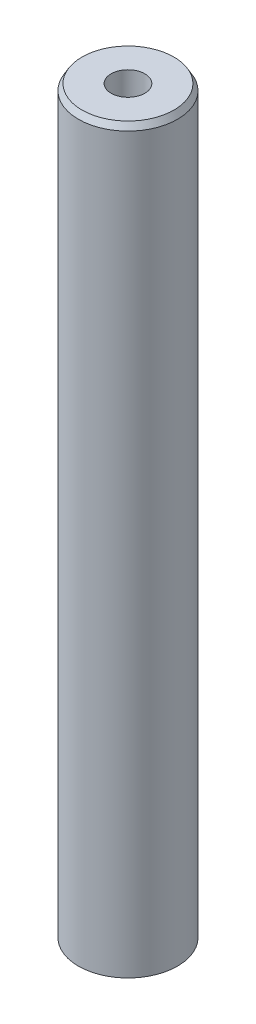
ISO-10303-21;
HEADER;
FILE_DESCRIPTION(('STEP AP214'),'2;1');
FILE_NAME('part.step','',(''),(''),'','','');
FILE_SCHEMA(('AUTOMOTIVE_DESIGN { 1 0 10303 214 1 1 1 1 }'));
ENDSEC;
DATA;
#1=APPLICATION_CONTEXT('core data for automotive mechanical design processes');
#2=APPLICATION_PROTOCOL_DEFINITION('international standard','automotive_design',2000,#1);
#3=PRODUCT_CONTEXT('',#1,'mechanical');
#4=PRODUCT('Part','Part','',(#3));
#5=PRODUCT_RELATED_PRODUCT_CATEGORY('part','',(#4));
#6=PRODUCT_DEFINITION_FORMATION('','',#4);
#7=PRODUCT_DEFINITION_CONTEXT('part definition',#1,'design');
#8=PRODUCT_DEFINITION('design','',#6,#7);
#9=PRODUCT_DEFINITION_SHAPE('','',#8);
#10=(LENGTH_UNIT() NAMED_UNIT(*) SI_UNIT(.MILLI.,.METRE.));
#11=(NAMED_UNIT(*) PLANE_ANGLE_UNIT() SI_UNIT($,.RADIAN.));
#12=(NAMED_UNIT(*) SI_UNIT($,.STERADIAN.) SOLID_ANGLE_UNIT());
#13=UNCERTAINTY_MEASURE_WITH_UNIT(LENGTH_MEASURE(1.E-05),#10,'distance_accuracy_value','');
#14=(GEOMETRIC_REPRESENTATION_CONTEXT(3) GLOBAL_UNCERTAINTY_ASSIGNED_CONTEXT((#13)) GLOBAL_UNIT_ASSIGNED_CONTEXT((#10,
#11,#12)) REPRESENTATION_CONTEXT('',''));
#15=CARTESIAN_POINT('',(0.,0.,0.));
#16=DIRECTION('',(0.,0.,1.));
#17=DIRECTION('',(1.,0.,0.));
#18=AXIS2_PLACEMENT_3D('',#15,#16,#17);
#19=CARTESIAN_POINT('',(0.,600.,0.));
#20=DIRECTION('',(0.,-1.,0.));
#21=DIRECTION('',(0.,0.,-1.));
#22=AXIS2_PLACEMENT_3D('',#19,#20,#21);
#23=CYLINDRICAL_SURFACE('',#22,40.);
#24=CARTESIAN_POINT('',(0.,594.995061749295,0.));
#25=DIRECTION('',(0.,1.,0.));
#26=DIRECTION('',(0.,0.,1.));
#27=AXIS2_PLACEMENT_3D('',#24,#25,#26);
#28=CIRCLE('',#27,40.);
#29=CARTESIAN_POINT('',(0.,594.995061749295,40.));
#30=VERTEX_POINT('',#29);
#31=EDGE_CURVE('E50',#30,#30,#28,.F.);
#32=ORIENTED_EDGE('',*,*,#31,.T.);
#33=EDGE_LOOP('',(#32));
#34=FACE_BOUND('',#33,.T.);
#35=CARTESIAN_POINT('',(0.,2.88960244632197,0.));
#36=DIRECTION('',(0.,1.,0.));
#37=DIRECTION('',(0.,0.,1.));
#38=AXIS2_PLACEMENT_3D('',#35,#36,#37);
#39=CIRCLE('',#38,40.);
#40=CARTESIAN_POINT('',(0.,2.88960244632197,40.));
#41=VERTEX_POINT('',#40);
#42=EDGE_CURVE('E51',#41,#41,#39,.T.);
#43=ORIENTED_EDGE('',*,*,#42,.T.);
#44=EDGE_LOOP('',(#43));
#45=FACE_BOUND('',#44,.T.);
#46=ADVANCED_FACE('F39',(#34,#45),#23,.T.);
#47=CARTESIAN_POINT('',(0.,600.,0.));
#48=DIRECTION('',(0.,1.,0.));
#49=DIRECTION('',(0.,0.,1.));
#50=AXIS2_PLACEMENT_3D('',#47,#48,#49);
#51=PLANE('',#50);
#52=CARTESIAN_POINT('',(0.,600.,0.));
#53=DIRECTION('',(0.,1.,0.));
#54=DIRECTION('',(0.,0.,1.));
#55=AXIS2_PLACEMENT_3D('',#52,#53,#54);
#56=CIRCLE('',#55,37.110397553678);
#57=CARTESIAN_POINT('',(0.,600.,37.110397553678));
#58=VERTEX_POINT('',#57);
#59=EDGE_CURVE('E54',#58,#58,#56,.T.);
#60=ORIENTED_EDGE('',*,*,#59,.T.);
#61=EDGE_LOOP('',(#60));
#62=FACE_BOUND('',#61,.T.);
#63=CARTESIAN_POINT('',(0.,600.,0.));
#64=DIRECTION('',(0.,1.,0.));
#65=DIRECTION('',(0.,0.,1.));
#66=AXIS2_PLACEMENT_3D('',#63,#64,#65);
#67=CIRCLE('',#66,13.6341225634621);
#68=CARTESIAN_POINT('',(0.,600.,13.6341225634621));
#69=VERTEX_POINT('',#68);
#70=EDGE_CURVE('E58',#69,#69,#67,.T.);
#71=ORIENTED_EDGE('',*,*,#70,.F.);
#72=EDGE_LOOP('',(#71));
#73=FACE_BOUND('',#72,.T.);
#74=ADVANCED_FACE('F69',(#62,#73),#51,.T.);
#75=CARTESIAN_POINT('',(0.,0.,0.));
#76=DIRECTION('',(0.,1.,0.));
#77=DIRECTION('',(0.,0.,1.));
#78=AXIS2_PLACEMENT_3D('',#75,#76,#77);
#79=PLANE('',#78);
#80=CARTESIAN_POINT('',(0.,0.,0.));
#81=DIRECTION('',(0.,1.,0.));
#82=DIRECTION('',(0.,0.,1.));
#83=AXIS2_PLACEMENT_3D('',#80,#81,#82);
#84=CIRCLE('',#83,34.9950617492951);
#85=CARTESIAN_POINT('',(0.,0.,34.9950617492951));
#86=VERTEX_POINT('',#85);
#87=EDGE_CURVE('E10',#86,#86,#84,.F.);
#88=ORIENTED_EDGE('',*,*,#87,.T.);
#89=EDGE_LOOP('',(#88));
#90=FACE_BOUND('',#89,.T.);
#91=CARTESIAN_POINT('',(0.,0.,0.));
#92=DIRECTION('',(0.,1.,0.));
#93=DIRECTION('',(0.,0.,1.));
#94=AXIS2_PLACEMENT_3D('',#91,#92,#93);
#95=CIRCLE('',#94,13.6341225634621);
#96=CARTESIAN_POINT('',(0.,0.,13.6341225634621));
#97=VERTEX_POINT('',#96);
#98=EDGE_CURVE('E63',#97,#97,#95,.T.);
#99=ORIENTED_EDGE('',*,*,#98,.T.);
#100=EDGE_LOOP('',(#99));
#101=FACE_BOUND('',#100,.T.);
#102=ADVANCED_FACE('F75',(#90,#101),#79,.F.);
#103=CARTESIAN_POINT('',(0.,600.,0.));
#104=DIRECTION('',(0.,-1.,0.));
#105=DIRECTION('',(0.,0.,-1.));
#106=AXIS2_PLACEMENT_3D('',#103,#104,#105);
#107=CYLINDRICAL_SURFACE('',#106,13.6341225634621);
#108=ORIENTED_EDGE('',*,*,#70,.T.);
#109=EDGE_LOOP('',(#108));
#110=FACE_BOUND('',#109,.T.);
#111=ORIENTED_EDGE('',*,*,#98,.F.);
#112=EDGE_LOOP('',(#111));
#113=FACE_BOUND('',#112,.T.);
#114=ADVANCED_FACE('F70',(#110,#113),#107,.F.);
#115=CARTESIAN_POINT('',(0.,600.,0.));
#116=DIRECTION('',(0.,-1.,0.));
#117=DIRECTION('',(0.,0.,-1.));
#118=AXIS2_PLACEMENT_3D('',#115,#116,#117);
#119=CONICAL_SURFACE('',#118,37.110397553678,0.523598775598297);
#120=ORIENTED_EDGE('',*,*,#31,.F.);
#121=EDGE_LOOP('',(#120));
#122=FACE_BOUND('',#121,.T.);
#123=ORIENTED_EDGE('',*,*,#59,.F.);
#124=EDGE_LOOP('',(#123));
#125=FACE_BOUND('',#124,.T.);
#126=ADVANCED_FACE('F81',(#122,#125),#119,.T.);
#127=CARTESIAN_POINT('',(0.,2.88960244632197,0.));
#128=DIRECTION('',(0.,1.,0.));
#129=DIRECTION('',(0.,0.,1.));
#130=AXIS2_PLACEMENT_3D('',#127,#128,#129);
#131=CONICAL_SURFACE('',#130,40.,1.04719755119659);
#132=ORIENTED_EDGE('',*,*,#87,.F.);
#133=EDGE_LOOP('',(#132));
#134=FACE_BOUND('',#133,.T.);
#135=ORIENTED_EDGE('',*,*,#42,.F.);
#136=EDGE_LOOP('',(#135));
#137=FACE_BOUND('',#136,.T.);
#138=ADVANCED_FACE('F45',(#134,#137),#131,.T.);
#139=CLOSED_SHELL('',(#46,#74,#102,#114,#126,#138));
#140=MANIFOLD_SOLID_BREP('B2',#139);
#141=ADVANCED_BREP_SHAPE_REPRESENTATION('',(#18,#140),#14);
#142=SHAPE_DEFINITION_REPRESENTATION(#9,#141);
ENDSEC;
END-ISO-10303-21;
